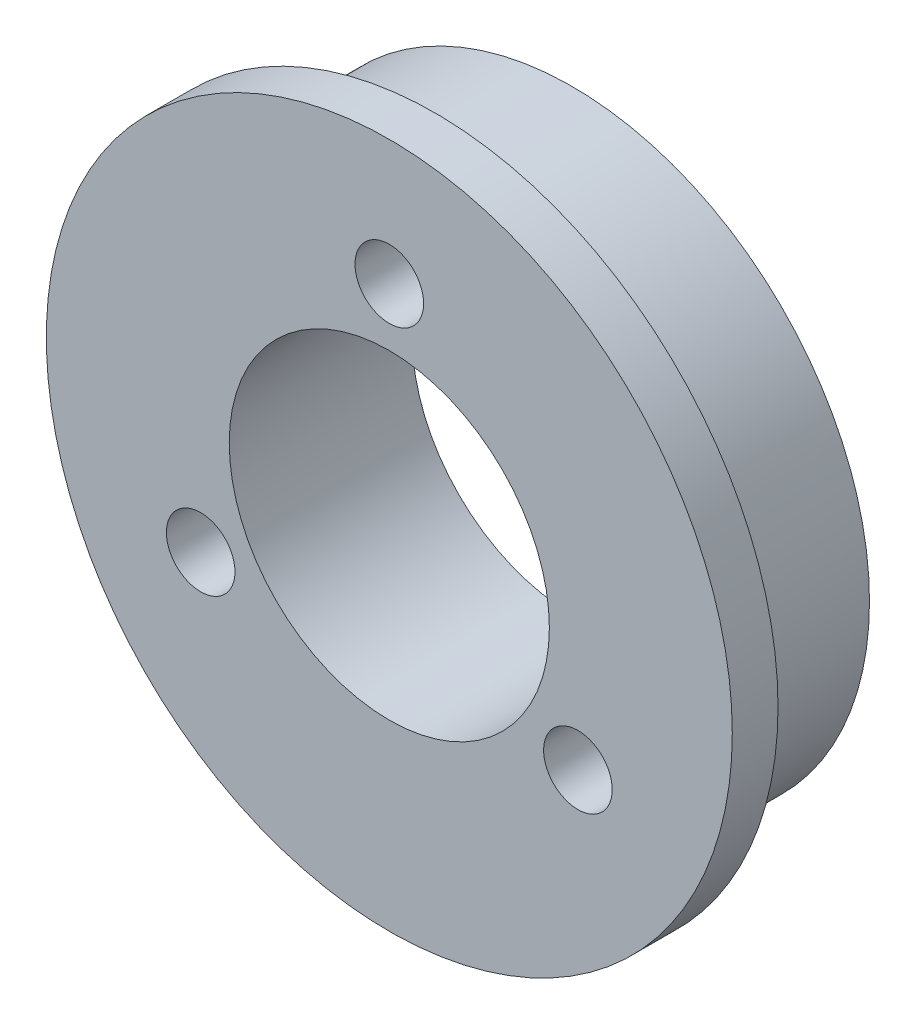
ISO-10303-21;
HEADER;
FILE_DESCRIPTION(('STEP AP214'),'2;1');
FILE_NAME('part.step','',(''),(''),'','','');
FILE_SCHEMA(('AUTOMOTIVE_DESIGN { 1 0 10303 214 1 1 1 1 }'));
ENDSEC;
DATA;
#1=APPLICATION_CONTEXT('core data for automotive mechanical design processes');
#2=APPLICATION_PROTOCOL_DEFINITION('international standard','automotive_design',2000,#1);
#3=PRODUCT_CONTEXT('',#1,'mechanical');
#4=PRODUCT('Part','Part','',(#3));
#5=PRODUCT_RELATED_PRODUCT_CATEGORY('part','',(#4));
#6=PRODUCT_DEFINITION_FORMATION('','',#4);
#7=PRODUCT_DEFINITION_CONTEXT('part definition',#1,'design');
#8=PRODUCT_DEFINITION('design','',#6,#7);
#9=PRODUCT_DEFINITION_SHAPE('','',#8);
#10=(LENGTH_UNIT() NAMED_UNIT(*) SI_UNIT(.MILLI.,.METRE.));
#11=(NAMED_UNIT(*) PLANE_ANGLE_UNIT() SI_UNIT($,.RADIAN.));
#12=(NAMED_UNIT(*) SI_UNIT($,.STERADIAN.) SOLID_ANGLE_UNIT());
#13=UNCERTAINTY_MEASURE_WITH_UNIT(LENGTH_MEASURE(1.E-05),#10,'distance_accuracy_value','');
#14=(GEOMETRIC_REPRESENTATION_CONTEXT(3) GLOBAL_UNCERTAINTY_ASSIGNED_CONTEXT((#13)) GLOBAL_UNIT_ASSIGNED_CONTEXT((#10,
#11,#12)) REPRESENTATION_CONTEXT('',''));
#15=CARTESIAN_POINT('',(0.,0.,0.));
#16=DIRECTION('',(0.,0.,1.));
#17=DIRECTION('',(1.,0.,0.));
#18=AXIS2_PLACEMENT_3D('',#15,#16,#17);
#19=CARTESIAN_POINT('',(0.,0.,0.));
#20=DIRECTION('',(0.,0.,1.));
#21=DIRECTION('',(1.,0.,0.));
#22=AXIS2_PLACEMENT_3D('',#19,#20,#21);
#23=PLANE('',#22);
#24=CARTESIAN_POINT('',(6.55920312805109E-13,9.52499999999966,0.));
#25=DIRECTION('',(0.,0.,1.));
#26=DIRECTION('',(1.,0.,0.));
#27=AXIS2_PLACEMENT_3D('',#24,#25,#26);
#28=CIRCLE('',#27,1.49999999999947);
#29=CARTESIAN_POINT('',(1.50000000000013,9.52499999999966,0.));
#30=VERTEX_POINT('',#29);
#31=EDGE_CURVE('E67',#30,#30,#28,.T.);
#32=ORIENTED_EDGE('',*,*,#31,.T.);
#33=EDGE_LOOP('',(#32));
#34=FACE_BOUND('',#33,.T.);
#35=CARTESIAN_POINT('',(8.24889197104676,-4.76250000000004,0.));
#36=DIRECTION('',(0.,0.,1.));
#37=DIRECTION('',(1.,0.,0.));
#38=AXIS2_PLACEMENT_3D('',#35,#36,#37);
#39=CIRCLE('',#38,1.5);
#40=CARTESIAN_POINT('',(9.74889197104676,-4.76250000000004,0.));
#41=VERTEX_POINT('',#40);
#42=EDGE_CURVE('E71',#41,#41,#39,.T.);
#43=ORIENTED_EDGE('',*,*,#42,.T.);
#44=EDGE_LOOP('',(#43));
#45=FACE_BOUND('',#44,.T.);
#46=CARTESIAN_POINT('',(-8.2488919710462,-4.76249999999961,0.));
#47=DIRECTION('',(0.,0.,1.));
#48=DIRECTION('',(1.,0.,0.));
#49=AXIS2_PLACEMENT_3D('',#46,#47,#48);
#50=CIRCLE('',#49,1.50000000000024);
#51=CARTESIAN_POINT('',(-6.74889197104596,-4.76249999999961,0.));
#52=VERTEX_POINT('',#51);
#53=EDGE_CURVE('E75',#52,#52,#50,.T.);
#54=ORIENTED_EDGE('',*,*,#53,.T.);
#55=EDGE_LOOP('',(#54));
#56=FACE_BOUND('',#55,.T.);
#57=CARTESIAN_POINT('',(0.,0.,0.));
#58=DIRECTION('',(0.,0.,1.));
#59=DIRECTION('',(1.,0.,0.));
#60=AXIS2_PLACEMENT_3D('',#57,#58,#59);
#61=CIRCLE('',#60,13.);
#62=CARTESIAN_POINT('',(13.,0.,0.));
#63=VERTEX_POINT('',#62);
#64=EDGE_CURVE('E41',#63,#63,#61,.T.);
#65=ORIENTED_EDGE('',*,*,#64,.F.);
#66=EDGE_LOOP('',(#65));
#67=FACE_BOUND('',#66,.T.);
#68=CARTESIAN_POINT('',(0.,0.,0.));
#69=DIRECTION('',(0.,0.,1.));
#70=DIRECTION('',(1.,0.,0.));
#71=AXIS2_PLACEMENT_3D('',#68,#69,#70);
#72=CIRCLE('',#71,7.);
#73=CARTESIAN_POINT('',(7.,0.,0.));
#74=VERTEX_POINT('',#73);
#75=EDGE_CURVE('E50',#74,#74,#72,.T.);
#76=ORIENTED_EDGE('',*,*,#75,.T.);
#77=EDGE_LOOP('',(#76));
#78=FACE_BOUND('',#77,.T.);
#79=ADVANCED_FACE('F37',(#34,#45,#56,#67,#78),#23,.F.);
#80=CARTESIAN_POINT('',(0.,0.,6.));
#81=DIRECTION('',(0.,0.,-1.));
#82=DIRECTION('',(-1.,0.,0.));
#83=AXIS2_PLACEMENT_3D('',#80,#81,#82);
#84=CYLINDRICAL_SURFACE('',#83,13.);
#85=CARTESIAN_POINT('',(0.,0.,6.));
#86=DIRECTION('',(0.,0.,1.));
#87=DIRECTION('',(1.,0.,0.));
#88=AXIS2_PLACEMENT_3D('',#85,#86,#87);
#89=CIRCLE('',#88,13.);
#90=CARTESIAN_POINT('',(13.,0.,6.));
#91=VERTEX_POINT('',#90);
#92=EDGE_CURVE('E10',#91,#91,#89,.T.);
#93=ORIENTED_EDGE('',*,*,#92,.F.);
#94=EDGE_LOOP('',(#93));
#95=FACE_BOUND('',#94,.T.);
#96=ORIENTED_EDGE('',*,*,#64,.T.);
#97=EDGE_LOOP('',(#96));
#98=FACE_BOUND('',#97,.T.);
#99=ADVANCED_FACE('F39',(#95,#98),#84,.T.);
#100=CARTESIAN_POINT('',(0.,0.,6.));
#101=DIRECTION('',(0.,0.,-1.));
#102=DIRECTION('',(-1.,0.,0.));
#103=AXIS2_PLACEMENT_3D('',#100,#101,#102);
#104=CYLINDRICAL_SURFACE('',#103,7.);
#105=ORIENTED_EDGE('',*,*,#75,.F.);
#106=EDGE_LOOP('',(#105));
#107=FACE_BOUND('',#106,.T.);
#108=CARTESIAN_POINT('',(0.,0.,8.));
#109=DIRECTION('',(0.,0.,1.));
#110=DIRECTION('',(1.,0.,0.));
#111=AXIS2_PLACEMENT_3D('',#108,#109,#110);
#112=CIRCLE('',#111,7.);
#113=CARTESIAN_POINT('',(7.,0.,8.));
#114=VERTEX_POINT('',#113);
#115=EDGE_CURVE('E60',#114,#114,#112,.T.);
#116=ORIENTED_EDGE('',*,*,#115,.T.);
#117=EDGE_LOOP('',(#116));
#118=FACE_BOUND('',#117,.T.);
#119=ADVANCED_FACE('F99',(#107,#118),#104,.F.);
#120=CARTESIAN_POINT('',(0.,0.,8.));
#121=DIRECTION('',(0.,0.,1.));
#122=DIRECTION('',(1.,0.,0.));
#123=AXIS2_PLACEMENT_3D('',#120,#121,#122);
#124=PLANE('',#123);
#125=CARTESIAN_POINT('',(6.55920312805109E-13,9.52499999999966,8.));
#126=DIRECTION('',(0.,0.,1.));
#127=DIRECTION('',(1.,0.,0.));
#128=AXIS2_PLACEMENT_3D('',#125,#126,#127);
#129=CIRCLE('',#128,1.49999999999947);
#130=CARTESIAN_POINT('',(1.50000000000013,9.52499999999966,8.));
#131=VERTEX_POINT('',#130);
#132=EDGE_CURVE('E79',#131,#131,#129,.T.);
#133=ORIENTED_EDGE('',*,*,#132,.F.);
#134=EDGE_LOOP('',(#133));
#135=FACE_BOUND('',#134,.T.);
#136=CARTESIAN_POINT('',(8.24889197104676,-4.76250000000004,8.));
#137=DIRECTION('',(0.,0.,1.));
#138=DIRECTION('',(1.,0.,0.));
#139=AXIS2_PLACEMENT_3D('',#136,#137,#138);
#140=CIRCLE('',#139,1.5);
#141=CARTESIAN_POINT('',(9.74889197104676,-4.76250000000004,8.));
#142=VERTEX_POINT('',#141);
#143=EDGE_CURVE('E84',#142,#142,#140,.T.);
#144=ORIENTED_EDGE('',*,*,#143,.F.);
#145=EDGE_LOOP('',(#144));
#146=FACE_BOUND('',#145,.T.);
#147=CARTESIAN_POINT('',(-8.2488919710462,-4.76249999999961,8.));
#148=DIRECTION('',(0.,0.,1.));
#149=DIRECTION('',(1.,0.,0.));
#150=AXIS2_PLACEMENT_3D('',#147,#148,#149);
#151=CIRCLE('',#150,1.50000000000024);
#152=CARTESIAN_POINT('',(-6.74889197104596,-4.76249999999961,8.));
#153=VERTEX_POINT('',#152);
#154=EDGE_CURVE('E80',#153,#153,#151,.T.);
#155=ORIENTED_EDGE('',*,*,#154,.F.);
#156=EDGE_LOOP('',(#155));
#157=FACE_BOUND('',#156,.T.);
#158=CARTESIAN_POINT('',(0.,0.,8.));
#159=DIRECTION('',(0.,0.,1.));
#160=DIRECTION('',(1.,0.,0.));
#161=AXIS2_PLACEMENT_3D('',#158,#159,#160);
#162=CIRCLE('',#161,15.);
#163=CARTESIAN_POINT('',(15.,0.,8.));
#164=VERTEX_POINT('',#163);
#165=EDGE_CURVE('E55',#164,#164,#162,.T.);
#166=ORIENTED_EDGE('',*,*,#165,.T.);
#167=EDGE_LOOP('',(#166));
#168=FACE_BOUND('',#167,.T.);
#169=ORIENTED_EDGE('',*,*,#115,.F.);
#170=EDGE_LOOP('',(#169));
#171=FACE_BOUND('',#170,.T.);
#172=ADVANCED_FACE('F95',(#135,#146,#157,#168,#171),#124,.T.);
#173=CARTESIAN_POINT('',(0.,0.,6.));
#174=DIRECTION('',(0.,0.,1.));
#175=DIRECTION('',(1.,0.,0.));
#176=AXIS2_PLACEMENT_3D('',#173,#174,#175);
#177=PLANE('',#176);
#178=ORIENTED_EDGE('',*,*,#92,.T.);
#179=EDGE_LOOP('',(#178));
#180=FACE_BOUND('',#179,.T.);
#181=CARTESIAN_POINT('',(0.,0.,6.));
#182=DIRECTION('',(0.,0.,1.));
#183=DIRECTION('',(1.,0.,0.));
#184=AXIS2_PLACEMENT_3D('',#181,#182,#183);
#185=CIRCLE('',#184,15.);
#186=CARTESIAN_POINT('',(15.,0.,6.));
#187=VERTEX_POINT('',#186);
#188=EDGE_CURVE('E56',#187,#187,#185,.T.);
#189=ORIENTED_EDGE('',*,*,#188,.F.);
#190=EDGE_LOOP('',(#189));
#191=FACE_BOUND('',#190,.T.);
#192=ADVANCED_FACE('F98',(#180,#191),#177,.F.);
#193=CARTESIAN_POINT('',(0.,0.,8.));
#194=DIRECTION('',(0.,0.,-1.));
#195=DIRECTION('',(-1.,0.,0.));
#196=AXIS2_PLACEMENT_3D('',#193,#194,#195);
#197=CYLINDRICAL_SURFACE('',#196,15.);
#198=ORIENTED_EDGE('',*,*,#165,.F.);
#199=EDGE_LOOP('',(#198));
#200=FACE_BOUND('',#199,.T.);
#201=ORIENTED_EDGE('',*,*,#188,.T.);
#202=EDGE_LOOP('',(#201));
#203=FACE_BOUND('',#202,.T.);
#204=ADVANCED_FACE('F135',(#200,#203),#197,.T.);
#205=CARTESIAN_POINT('',(-8.2488919710462,-4.76249999999961,-8.));
#206=DIRECTION('',(0.,0.,1.));
#207=DIRECTION('',(1.,0.,0.));
#208=AXIS2_PLACEMENT_3D('',#205,#206,#207);
#209=CYLINDRICAL_SURFACE('',#208,1.50000000000024);
#210=ORIENTED_EDGE('',*,*,#154,.T.);
#211=EDGE_LOOP('',(#210));
#212=FACE_BOUND('',#211,.T.);
#213=ORIENTED_EDGE('',*,*,#53,.F.);
#214=EDGE_LOOP('',(#213));
#215=FACE_BOUND('',#214,.T.);
#216=ADVANCED_FACE('F132',(#212,#215),#209,.F.);
#217=CARTESIAN_POINT('',(8.24889197104676,-4.76250000000004,-8.));
#218=DIRECTION('',(0.,0.,1.));
#219=DIRECTION('',(1.,0.,0.));
#220=AXIS2_PLACEMENT_3D('',#217,#218,#219);
#221=CYLINDRICAL_SURFACE('',#220,1.5);
#222=ORIENTED_EDGE('',*,*,#143,.T.);
#223=EDGE_LOOP('',(#222));
#224=FACE_BOUND('',#223,.T.);
#225=ORIENTED_EDGE('',*,*,#42,.F.);
#226=EDGE_LOOP('',(#225));
#227=FACE_BOUND('',#226,.T.);
#228=ADVANCED_FACE('F134',(#224,#227),#221,.F.);
#229=CARTESIAN_POINT('',(6.55920312805109E-13,9.52499999999966,-8.));
#230=DIRECTION('',(0.,0.,1.));
#231=DIRECTION('',(1.,0.,0.));
#232=AXIS2_PLACEMENT_3D('',#229,#230,#231);
#233=CYLINDRICAL_SURFACE('',#232,1.49999999999947);
#234=ORIENTED_EDGE('',*,*,#132,.T.);
#235=EDGE_LOOP('',(#234));
#236=FACE_BOUND('',#235,.T.);
#237=ORIENTED_EDGE('',*,*,#31,.F.);
#238=EDGE_LOOP('',(#237));
#239=FACE_BOUND('',#238,.T.);
#240=ADVANCED_FACE('F92',(#236,#239),#233,.F.);
#241=CLOSED_SHELL('',(#79,#99,#119,#172,#192,#204,#216,#228,#240));
#242=MANIFOLD_SOLID_BREP('B2',#241);
#243=ADVANCED_BREP_SHAPE_REPRESENTATION('',(#18,#242),#14);
#244=SHAPE_DEFINITION_REPRESENTATION(#9,#243);
ENDSEC;
END-ISO-10303-21;
